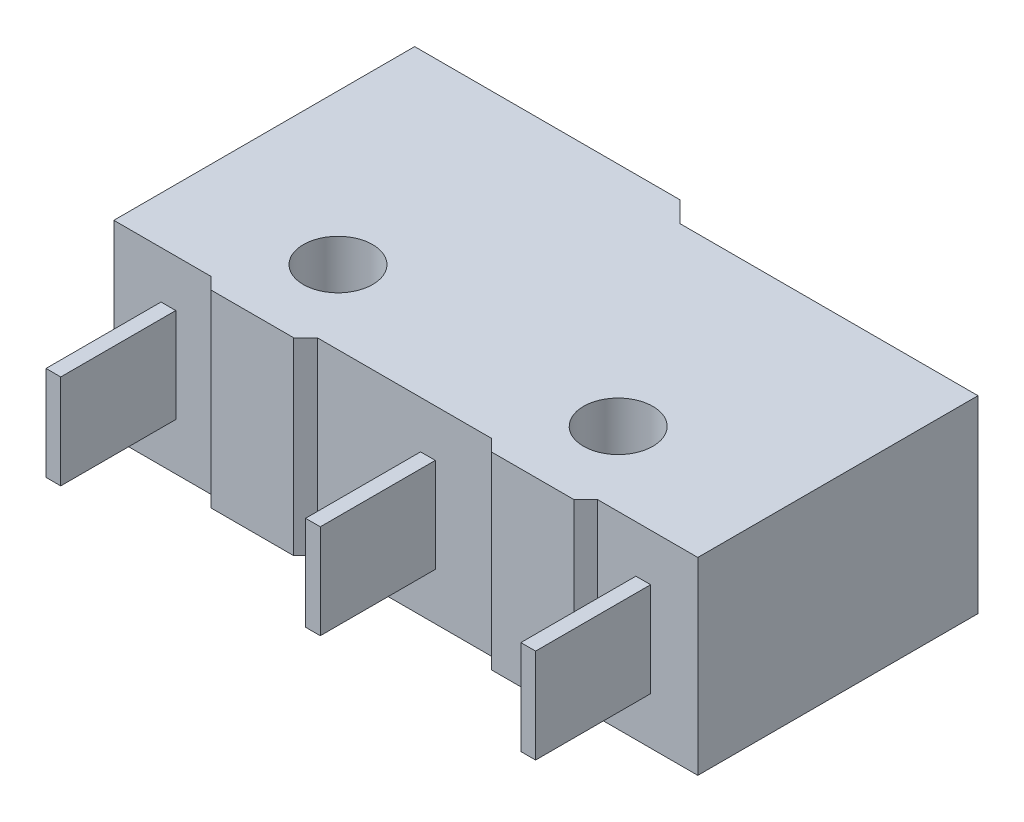
ISO-10303-21;
HEADER;
FILE_DESCRIPTION(('STEP AP214'),'2;1');
FILE_NAME('part.step','',(''),(''),'','','');
FILE_SCHEMA(('AUTOMOTIVE_DESIGN { 1 0 10303 214 1 1 1 1 }'));
ENDSEC;
DATA;
#1=APPLICATION_CONTEXT('core data for automotive mechanical design processes');
#2=APPLICATION_PROTOCOL_DEFINITION('international standard','automotive_design',2000,#1);
#3=PRODUCT_CONTEXT('',#1,'mechanical');
#4=PRODUCT('Part','Part','',(#3));
#5=PRODUCT_RELATED_PRODUCT_CATEGORY('part','',(#4));
#6=PRODUCT_DEFINITION_FORMATION('','',#4);
#7=PRODUCT_DEFINITION_CONTEXT('part definition',#1,'design');
#8=PRODUCT_DEFINITION('design','',#6,#7);
#9=PRODUCT_DEFINITION_SHAPE('','',#8);
#10=(LENGTH_UNIT() NAMED_UNIT(*) SI_UNIT(.MILLI.,.METRE.));
#11=(NAMED_UNIT(*) PLANE_ANGLE_UNIT() SI_UNIT($,.RADIAN.));
#12=(NAMED_UNIT(*) SI_UNIT($,.STERADIAN.) SOLID_ANGLE_UNIT());
#13=UNCERTAINTY_MEASURE_WITH_UNIT(LENGTH_MEASURE(1.E-05),#10,'distance_accuracy_value','');
#14=(GEOMETRIC_REPRESENTATION_CONTEXT(3) GLOBAL_UNCERTAINTY_ASSIGNED_CONTEXT((#13)) GLOBAL_UNIT_ASSIGNED_CONTEXT((#10,
#11,#12)) REPRESENTATION_CONTEXT('',''));
#15=CARTESIAN_POINT('',(0.,0.,0.));
#16=DIRECTION('',(0.,0.,1.));
#17=DIRECTION('',(1.,0.,0.));
#18=AXIS2_PLACEMENT_3D('',#15,#16,#17);
#19=CARTESIAN_POINT('',(11.3,6.4,2.5));
#20=DIRECTION('',(0.,0.,-1.));
#21=DIRECTION('',(-1.,0.,0.));
#22=AXIS2_PLACEMENT_3D('',#19,#20,#21);
#23=PLANE('',#22);
#24=DIRECTION('',(1.,0.,0.));
#25=VECTOR('',#24,1.);
#26=CARTESIAN_POINT('',(11.3,0.,2.5));
#27=LINE('',#26,#25);
#28=CARTESIAN_POINT('',(11.3,0.,2.5));
#29=VERTEX_POINT('',#28);
#30=CARTESIAN_POINT('',(14.7,0.,2.5));
#31=VERTEX_POINT('',#30);
#32=EDGE_CURVE('E489',#29,#31,#27,.T.);
#33=ORIENTED_EDGE('',*,*,#32,.T.);
#34=DIRECTION('',(0.,-1.,0.));
#35=VECTOR('',#34,1.);
#36=CARTESIAN_POINT('',(14.7,6.4,2.5));
#37=LINE('',#36,#35);
#38=CARTESIAN_POINT('',(14.7,6.4,2.5));
#39=VERTEX_POINT('',#38);
#40=EDGE_CURVE('E492',#39,#31,#37,.T.);
#41=ORIENTED_EDGE('',*,*,#40,.F.);
#42=DIRECTION('',(1.,0.,0.));
#43=VECTOR('',#42,1.);
#44=CARTESIAN_POINT('',(11.3,6.4,2.5));
#45=LINE('',#44,#43);
#46=CARTESIAN_POINT('',(11.3,6.4,2.5));
#47=VERTEX_POINT('',#46);
#48=EDGE_CURVE('E496',#47,#39,#45,.T.);
#49=ORIENTED_EDGE('',*,*,#48,.F.);
#50=DIRECTION('',(0.,-1.,0.));
#51=VECTOR('',#50,1.);
#52=CARTESIAN_POINT('',(11.3,6.4,2.5));
#53=LINE('',#52,#51);
#54=EDGE_CURVE('E495',#47,#29,#53,.T.);
#55=ORIENTED_EDGE('',*,*,#54,.T.);
#56=EDGE_LOOP('',(#33,#41,#49,#55));
#57=FACE_BOUND('',#56,.T.);
#58=DIRECTION('',(-1.,0.,0.));
#59=VECTOR('',#58,1.);
#60=CARTESIAN_POINT('',(12.6,1.6,2.5));
#61=LINE('',#60,#59);
#62=CARTESIAN_POINT('',(13.1,1.6,2.5));
#63=VERTEX_POINT('',#62);
#64=CARTESIAN_POINT('',(12.6,1.6,2.5));
#65=VERTEX_POINT('',#64);
#66=EDGE_CURVE('E255',#63,#65,#61,.T.);
#67=ORIENTED_EDGE('',*,*,#66,.T.);
#68=DIRECTION('',(0.,1.,0.));
#69=VECTOR('',#68,1.);
#70=CARTESIAN_POINT('',(12.6,1.6,2.5));
#71=LINE('',#70,#69);
#72=CARTESIAN_POINT('',(12.6,4.8,2.5));
#73=VERTEX_POINT('',#72);
#74=EDGE_CURVE('E239',#65,#73,#71,.T.);
#75=ORIENTED_EDGE('',*,*,#74,.T.);
#76=DIRECTION('',(-1.,0.,0.));
#77=VECTOR('',#76,1.);
#78=CARTESIAN_POINT('',(12.6,4.8,2.5));
#79=LINE('',#78,#77);
#80=CARTESIAN_POINT('',(13.1,4.8,2.5));
#81=VERTEX_POINT('',#80);
#82=EDGE_CURVE('E259',#81,#73,#79,.T.);
#83=ORIENTED_EDGE('',*,*,#82,.F.);
#84=DIRECTION('',(0.,1.,0.));
#85=VECTOR('',#84,1.);
#86=CARTESIAN_POINT('',(13.1,1.6,2.5));
#87=LINE('',#86,#85);
#88=EDGE_CURVE('E248',#63,#81,#87,.T.);
#89=ORIENTED_EDGE('',*,*,#88,.F.);
#90=EDGE_LOOP('',(#67,#75,#83,#89));
#91=FACE_BOUND('',#90,.T.);
#92=ADVANCED_FACE('F39',(#57,#91),#23,.F.);
#93=CARTESIAN_POINT('',(7.7,6.4,2.5));
#94=DIRECTION('',(0.,0.,-1.));
#95=DIRECTION('',(-1.,0.,0.));
#96=AXIS2_PLACEMENT_3D('',#93,#94,#95);
#97=PLANE('',#96);
#98=DIRECTION('',(1.,0.,0.));
#99=VECTOR('',#98,1.);
#100=CARTESIAN_POINT('',(7.7,0.,2.5));
#101=LINE('',#100,#99);
#102=CARTESIAN_POINT('',(1.8,0.,2.5));
#103=VERTEX_POINT('',#102);
#104=CARTESIAN_POINT('',(7.7,0.,2.5));
#105=VERTEX_POINT('',#104);
#106=EDGE_CURVE('E480',#103,#105,#101,.T.);
#107=ORIENTED_EDGE('',*,*,#106,.T.);
#108=DIRECTION('',(0.,-1.,0.));
#109=VECTOR('',#108,1.);
#110=CARTESIAN_POINT('',(7.7,6.4,2.5));
#111=LINE('',#110,#109);
#112=CARTESIAN_POINT('',(7.7,6.4,2.5));
#113=VERTEX_POINT('',#112);
#114=EDGE_CURVE('E505',#113,#105,#111,.T.);
#115=ORIENTED_EDGE('',*,*,#114,.F.);
#116=DIRECTION('',(1.,0.,0.));
#117=VECTOR('',#116,1.);
#118=CARTESIAN_POINT('',(7.7,6.4,2.5));
#119=LINE('',#118,#117);
#120=CARTESIAN_POINT('',(1.8,6.4,2.5));
#121=VERTEX_POINT('',#120);
#122=EDGE_CURVE('E546',#121,#113,#119,.T.);
#123=ORIENTED_EDGE('',*,*,#122,.F.);
#124=DIRECTION('',(0.,-1.,0.));
#125=VECTOR('',#124,1.);
#126=CARTESIAN_POINT('',(1.8,6.4,2.5));
#127=LINE('',#126,#125);
#128=EDGE_CURVE('E508',#121,#103,#127,.T.);
#129=ORIENTED_EDGE('',*,*,#128,.T.);
#130=EDGE_LOOP('',(#107,#115,#123,#129));
#131=FACE_BOUND('',#130,.T.);
#132=DIRECTION('',(-1.,0.,0.));
#133=VECTOR('',#132,1.);
#134=CARTESIAN_POINT('',(5.3,1.6,2.5));
#135=LINE('',#134,#133);
#136=CARTESIAN_POINT('',(5.8,1.6,2.5));
#137=VERTEX_POINT('',#136);
#138=CARTESIAN_POINT('',(5.3,1.6,2.5));
#139=VERTEX_POINT('',#138);
#140=EDGE_CURVE('E278',#137,#139,#135,.T.);
#141=ORIENTED_EDGE('',*,*,#140,.T.);
#142=DIRECTION('',(0.,1.,0.));
#143=VECTOR('',#142,1.);
#144=CARTESIAN_POINT('',(5.3,1.6,2.5));
#145=LINE('',#144,#143);
#146=CARTESIAN_POINT('',(5.3,4.8,2.5));
#147=VERTEX_POINT('',#146);
#148=EDGE_CURVE('E275',#139,#147,#145,.T.);
#149=ORIENTED_EDGE('',*,*,#148,.T.);
#150=DIRECTION('',(-1.,0.,0.));
#151=VECTOR('',#150,1.);
#152=CARTESIAN_POINT('',(5.3,4.8,2.5));
#153=LINE('',#152,#151);
#154=CARTESIAN_POINT('',(5.8,4.8,2.5));
#155=VERTEX_POINT('',#154);
#156=EDGE_CURVE('E295',#155,#147,#153,.T.);
#157=ORIENTED_EDGE('',*,*,#156,.F.);
#158=DIRECTION('',(0.,1.,0.));
#159=VECTOR('',#158,1.);
#160=CARTESIAN_POINT('',(5.8,1.6,2.5));
#161=LINE('',#160,#159);
#162=EDGE_CURVE('E281',#137,#155,#161,.T.);
#163=ORIENTED_EDGE('',*,*,#162,.F.);
#164=EDGE_LOOP('',(#141,#149,#157,#163));
#165=FACE_BOUND('',#164,.T.);
#166=ADVANCED_FACE('F396',(#131,#165),#97,.F.);
#167=CARTESIAN_POINT('',(-1.8,6.4,2.5));
#168=DIRECTION('',(0.,0.,-1.));
#169=DIRECTION('',(-1.,0.,0.));
#170=AXIS2_PLACEMENT_3D('',#167,#168,#169);
#171=PLANE('',#170);
#172=DIRECTION('',(1.,0.,0.));
#173=VECTOR('',#172,1.);
#174=CARTESIAN_POINT('',(-1.8,0.,2.5));
#175=LINE('',#174,#173);
#176=CARTESIAN_POINT('',(-5.1,0.,2.5));
#177=VERTEX_POINT('',#176);
#178=CARTESIAN_POINT('',(-1.8,0.,2.5));
#179=VERTEX_POINT('',#178);
#180=EDGE_CURVE('E471',#177,#179,#175,.T.);
#181=ORIENTED_EDGE('',*,*,#180,.T.);
#182=DIRECTION('',(0.,-1.,0.));
#183=VECTOR('',#182,1.);
#184=CARTESIAN_POINT('',(-1.8,6.4,2.5));
#185=LINE('',#184,#183);
#186=CARTESIAN_POINT('',(-1.8,6.4,2.5));
#187=VERTEX_POINT('',#186);
#188=EDGE_CURVE('E517',#187,#179,#185,.T.);
#189=ORIENTED_EDGE('',*,*,#188,.F.);
#190=DIRECTION('',(1.,0.,0.));
#191=VECTOR('',#190,1.);
#192=CARTESIAN_POINT('',(-1.8,6.4,2.5));
#193=LINE('',#192,#191);
#194=CARTESIAN_POINT('',(-5.1,6.4,2.5));
#195=VERTEX_POINT('',#194);
#196=EDGE_CURVE('E533',#195,#187,#193,.T.);
#197=ORIENTED_EDGE('',*,*,#196,.F.);
#198=DIRECTION('',(0.,-1.,0.));
#199=VECTOR('',#198,1.);
#200=CARTESIAN_POINT('',(-5.1,6.4,2.5));
#201=LINE('',#200,#199);
#202=EDGE_CURVE('E520',#195,#177,#201,.T.);
#203=ORIENTED_EDGE('',*,*,#202,.T.);
#204=EDGE_LOOP('',(#181,#189,#197,#203));
#205=FACE_BOUND('',#204,.T.);
#206=DIRECTION('',(-1.,0.,0.));
#207=VECTOR('',#206,1.);
#208=CARTESIAN_POINT('',(-3.5,1.6,2.5));
#209=LINE('',#208,#207);
#210=CARTESIAN_POINT('',(-3.,1.6,2.5));
#211=VERTEX_POINT('',#210);
#212=CARTESIAN_POINT('',(-3.5,1.6,2.5));
#213=VERTEX_POINT('',#212);
#214=EDGE_CURVE('E321',#211,#213,#209,.T.);
#215=ORIENTED_EDGE('',*,*,#214,.T.);
#216=DIRECTION('',(0.,1.,0.));
#217=VECTOR('',#216,1.);
#218=CARTESIAN_POINT('',(-3.5,1.6,2.5));
#219=LINE('',#218,#217);
#220=CARTESIAN_POINT('',(-3.5,4.8,2.5));
#221=VERTEX_POINT('',#220);
#222=EDGE_CURVE('E325',#213,#221,#219,.T.);
#223=ORIENTED_EDGE('',*,*,#222,.T.);
#224=DIRECTION('',(-1.,0.,0.));
#225=VECTOR('',#224,1.);
#226=CARTESIAN_POINT('',(-3.5,4.8,2.5));
#227=LINE('',#226,#225);
#228=CARTESIAN_POINT('',(-3.,4.8,2.5));
#229=VERTEX_POINT('',#228);
#230=EDGE_CURVE('E311',#229,#221,#227,.T.);
#231=ORIENTED_EDGE('',*,*,#230,.F.);
#232=DIRECTION('',(0.,1.,0.));
#233=VECTOR('',#232,1.);
#234=CARTESIAN_POINT('',(-3.,1.6,2.5));
#235=LINE('',#234,#233);
#236=EDGE_CURVE('E329',#211,#229,#235,.T.);
#237=ORIENTED_EDGE('',*,*,#236,.F.);
#238=EDGE_LOOP('',(#215,#223,#231,#237));
#239=FACE_BOUND('',#238,.T.);
#240=ADVANCED_FACE('F412',(#205,#239),#171,.F.);
#241=CARTESIAN_POINT('',(-5.1,6.4,-7.7));
#242=DIRECTION('',(0.,0.,1.));
#243=DIRECTION('',(1.,0.,0.));
#244=AXIS2_PLACEMENT_3D('',#241,#242,#243);
#245=PLANE('',#244);
#246=DIRECTION('',(-1.,0.,0.));
#247=VECTOR('',#246,1.);
#248=CARTESIAN_POINT('',(-5.1,0.,-7.7));
#249=LINE('',#248,#247);
#250=CARTESIAN_POINT('',(3.9,0.,-7.7));
#251=VERTEX_POINT('',#250);
#252=CARTESIAN_POINT('',(-5.1,0.,-7.7));
#253=VERTEX_POINT('',#252);
#254=EDGE_CURVE('E464',#251,#253,#249,.T.);
#255=ORIENTED_EDGE('',*,*,#254,.T.);
#256=DIRECTION('',(0.,-1.,0.));
#257=VECTOR('',#256,1.);
#258=CARTESIAN_POINT('',(-5.1,6.4,-7.7));
#259=LINE('',#258,#257);
#260=CARTESIAN_POINT('',(-5.1,6.4,-7.7));
#261=VERTEX_POINT('',#260);
#262=EDGE_CURVE('E523',#261,#253,#259,.T.);
#263=ORIENTED_EDGE('',*,*,#262,.F.);
#264=DIRECTION('',(-1.,0.,0.));
#265=VECTOR('',#264,1.);
#266=CARTESIAN_POINT('',(-5.1,6.4,-7.7));
#267=LINE('',#266,#265);
#268=CARTESIAN_POINT('',(3.9,6.4,-7.7));
#269=VERTEX_POINT('',#268);
#270=EDGE_CURVE('E529',#269,#261,#267,.T.);
#271=ORIENTED_EDGE('',*,*,#270,.F.);
#272=DIRECTION('',(0.,-1.,0.));
#273=VECTOR('',#272,1.);
#274=CARTESIAN_POINT('',(3.9,6.4,-7.7));
#275=LINE('',#274,#273);
#276=EDGE_CURVE('E460',#269,#251,#275,.T.);
#277=ORIENTED_EDGE('',*,*,#276,.T.);
#278=EDGE_LOOP('',(#255,#263,#271,#277));
#279=FACE_BOUND('',#278,.T.);
#280=DIRECTION('',(1.,0.,0.));
#281=VECTOR('',#280,1.);
#282=CARTESIAN_POINT('',(3.,1.6,-7.7));
#283=LINE('',#282,#281);
#284=CARTESIAN_POINT('',(1.,1.6,-7.7));
#285=VERTEX_POINT('',#284);
#286=CARTESIAN_POINT('',(3.,1.6,-7.7));
#287=VERTEX_POINT('',#286);
#288=EDGE_CURVE('E639',#285,#287,#283,.T.);
#289=ORIENTED_EDGE('',*,*,#288,.T.);
#290=DIRECTION('',(0.,1.,0.));
#291=VECTOR('',#290,1.);
#292=CARTESIAN_POINT('',(3.,1.6,-7.7));
#293=LINE('',#292,#291);
#294=CARTESIAN_POINT('',(3.,4.8,-7.7));
#295=VERTEX_POINT('',#294);
#296=EDGE_CURVE('E643',#287,#295,#293,.T.);
#297=ORIENTED_EDGE('',*,*,#296,.T.);
#298=DIRECTION('',(1.,0.,0.));
#299=VECTOR('',#298,1.);
#300=CARTESIAN_POINT('',(3.,4.8,-7.7));
#301=LINE('',#300,#299);
#302=CARTESIAN_POINT('',(1.,4.8,-7.7));
#303=VERTEX_POINT('',#302);
#304=EDGE_CURVE('E347',#303,#295,#301,.T.);
#305=ORIENTED_EDGE('',*,*,#304,.F.);
#306=DIRECTION('',(0.,1.,0.));
#307=VECTOR('',#306,1.);
#308=CARTESIAN_POINT('',(1.,1.6,-7.7));
#309=LINE('',#308,#307);
#310=EDGE_CURVE('E645',#285,#303,#309,.T.);
#311=ORIENTED_EDGE('',*,*,#310,.F.);
#312=EDGE_LOOP('',(#289,#297,#305,#311));
#313=FACE_BOUND('',#312,.T.);
#314=ADVANCED_FACE('F389',(#279,#313),#245,.F.);
#315=CARTESIAN_POINT('',(0.,6.4,0.));
#316=DIRECTION('',(0.,-1.,0.));
#317=DIRECTION('',(0.,0.,-1.));
#318=AXIS2_PLACEMENT_3D('',#315,#316,#317);
#319=PLANE('',#318);
#320=DIRECTION('',(0.,0.,-1.));
#321=VECTOR('',#320,1.);
#322=CARTESIAN_POINT('',(14.7,6.4,2.5));
#323=LINE('',#322,#321);
#324=CARTESIAN_POINT('',(14.7,6.4,-7.));
#325=VERTEX_POINT('',#324);
#326=EDGE_CURVE('E491',#39,#325,#323,.T.);
#327=ORIENTED_EDGE('',*,*,#326,.T.);
#328=DIRECTION('',(-1.,0.,0.));
#329=VECTOR('',#328,1.);
#330=CARTESIAN_POINT('',(4.59999999999999,6.4,-7.));
#331=LINE('',#330,#329);
#332=CARTESIAN_POINT('',(4.59999999999999,6.4,-7.));
#333=VERTEX_POINT('',#332);
#334=EDGE_CURVE('E535',#325,#333,#331,.T.);
#335=ORIENTED_EDGE('',*,*,#334,.T.);
#336=DIRECTION('',(-0.707106781186544,0.,-0.707106781186551));
#337=VECTOR('',#336,1.);
#338=CARTESIAN_POINT('',(3.9,6.4,-7.7));
#339=LINE('',#338,#337);
#340=EDGE_CURVE('E459',#333,#269,#339,.T.);
#341=ORIENTED_EDGE('',*,*,#340,.T.);
#342=ORIENTED_EDGE('',*,*,#270,.T.);
#343=DIRECTION('',(0.,0.,1.));
#344=VECTOR('',#343,1.);
#345=CARTESIAN_POINT('',(-5.1,6.4,2.5));
#346=LINE('',#345,#344);
#347=EDGE_CURVE('E531',#261,#195,#346,.T.);
#348=ORIENTED_EDGE('',*,*,#347,.T.);
#349=ORIENTED_EDGE('',*,*,#196,.T.);
#350=DIRECTION('',(0.707106781186546,0.,0.707106781186549));
#351=VECTOR('',#350,1.);
#352=CARTESIAN_POINT('',(-1.4,6.4,2.9));
#353=LINE('',#352,#351);
#354=CARTESIAN_POINT('',(-1.4,6.4,2.9));
#355=VERTEX_POINT('',#354);
#356=EDGE_CURVE('E540',#187,#355,#353,.T.);
#357=ORIENTED_EDGE('',*,*,#356,.T.);
#358=DIRECTION('',(1.,0.,0.));
#359=VECTOR('',#358,1.);
#360=CARTESIAN_POINT('',(0.,6.4,2.9));
#361=LINE('',#360,#359);
#362=CARTESIAN_POINT('',(1.4,6.4,2.9));
#363=VERTEX_POINT('',#362);
#364=EDGE_CURVE('E542',#355,#363,#361,.T.);
#365=ORIENTED_EDGE('',*,*,#364,.T.);
#366=DIRECTION('',(0.707106781186546,0.,-0.707106781186549));
#367=VECTOR('',#366,1.);
#368=CARTESIAN_POINT('',(1.4,6.4,2.9));
#369=LINE('',#368,#367);
#370=EDGE_CURVE('E544',#363,#121,#369,.T.);
#371=ORIENTED_EDGE('',*,*,#370,.T.);
#372=ORIENTED_EDGE('',*,*,#122,.T.);
#373=DIRECTION('',(0.707106781186548,0.,0.707106781186547));
#374=VECTOR('',#373,1.);
#375=CARTESIAN_POINT('',(8.1,6.4,2.9));
#376=LINE('',#375,#374);
#377=CARTESIAN_POINT('',(8.1,6.4,2.9));
#378=VERTEX_POINT('',#377);
#379=EDGE_CURVE('E548',#113,#378,#376,.T.);
#380=ORIENTED_EDGE('',*,*,#379,.T.);
#381=DIRECTION('',(1.,0.,0.));
#382=VECTOR('',#381,1.);
#383=CARTESIAN_POINT('',(9.5,6.4,2.9));
#384=LINE('',#383,#382);
#385=CARTESIAN_POINT('',(10.9,6.4,2.9));
#386=VERTEX_POINT('',#385);
#387=EDGE_CURVE('E550',#378,#386,#384,.T.);
#388=ORIENTED_EDGE('',*,*,#387,.T.);
#389=DIRECTION('',(0.707106781186545,0.,-0.707106781186549));
#390=VECTOR('',#389,1.);
#391=CARTESIAN_POINT('',(10.9,6.4,2.9));
#392=LINE('',#391,#390);
#393=EDGE_CURVE('E552',#386,#47,#392,.T.);
#394=ORIENTED_EDGE('',*,*,#393,.T.);
#395=ORIENTED_EDGE('',*,*,#48,.T.);
#396=EDGE_LOOP('',(#327,#335,#341,#342,#348,#349,#357,#365,#371,#372,#380,#388,#394,#395));
#397=FACE_BOUND('',#396,.T.);
#398=CARTESIAN_POINT('',(0.,6.4,0.));
#399=DIRECTION('',(0.,1.,0.));
#400=DIRECTION('',(0.,0.,1.));
#401=AXIS2_PLACEMENT_3D('',#398,#399,#400);
#402=CIRCLE('',#401,1.175);
#403=CARTESIAN_POINT('',(0.,6.4,1.175));
#404=VERTEX_POINT('',#403);
#405=EDGE_CURVE('E554',#404,#404,#402,.T.);
#406=ORIENTED_EDGE('',*,*,#405,.F.);
#407=EDGE_LOOP('',(#406));
#408=FACE_BOUND('',#407,.T.);
#409=CARTESIAN_POINT('',(9.5,6.4,0.));
#410=DIRECTION('',(0.,1.,0.));
#411=DIRECTION('',(0.,0.,1.));
#412=AXIS2_PLACEMENT_3D('',#409,#410,#411);
#413=CIRCLE('',#412,1.175);
#414=CARTESIAN_POINT('',(9.5,6.4,1.175));
#415=VERTEX_POINT('',#414);
#416=EDGE_CURVE('E560',#415,#415,#413,.T.);
#417=ORIENTED_EDGE('',*,*,#416,.F.);
#418=EDGE_LOOP('',(#417));
#419=FACE_BOUND('',#418,.T.);
#420=ADVANCED_FACE('F385',(#397,#408,#419),#319,.F.);
#421=CARTESIAN_POINT('',(0.,0.,0.));
#422=DIRECTION('',(0.,-1.,0.));
#423=DIRECTION('',(0.,0.,-1.));
#424=AXIS2_PLACEMENT_3D('',#421,#422,#423);
#425=PLANE('',#424);
#426=CARTESIAN_POINT('',(0.,0.,0.));
#427=DIRECTION('',(0.,1.,0.));
#428=DIRECTION('',(0.,0.,1.));
#429=AXIS2_PLACEMENT_3D('',#426,#427,#428);
#430=CIRCLE('',#429,1.175);
#431=CARTESIAN_POINT('',(0.,0.,1.175));
#432=VERTEX_POINT('',#431);
#433=EDGE_CURVE('E556',#432,#432,#430,.T.);
#434=ORIENTED_EDGE('',*,*,#433,.T.);
#435=EDGE_LOOP('',(#434));
#436=FACE_BOUND('',#435,.T.);
#437=DIRECTION('',(0.,0.,-1.));
#438=VECTOR('',#437,1.);
#439=CARTESIAN_POINT('',(14.7,0.,2.5));
#440=LINE('',#439,#438);
#441=CARTESIAN_POINT('',(14.7,0.,-7.));
#442=VERTEX_POINT('',#441);
#443=EDGE_CURVE('E455',#31,#442,#440,.T.);
#444=ORIENTED_EDGE('',*,*,#443,.F.);
#445=ORIENTED_EDGE('',*,*,#32,.F.);
#446=DIRECTION('',(0.707106781186545,0.,-0.707106781186549));
#447=VECTOR('',#446,1.);
#448=CARTESIAN_POINT('',(10.9,0.,2.9));
#449=LINE('',#448,#447);
#450=CARTESIAN_POINT('',(10.9,0.,2.9));
#451=VERTEX_POINT('',#450);
#452=EDGE_CURVE('E487',#451,#29,#449,.T.);
#453=ORIENTED_EDGE('',*,*,#452,.F.);
#454=DIRECTION('',(1.,0.,0.));
#455=VECTOR('',#454,1.);
#456=CARTESIAN_POINT('',(9.5,0.,2.9));
#457=LINE('',#456,#455);
#458=CARTESIAN_POINT('',(8.1,0.,2.9));
#459=VERTEX_POINT('',#458);
#460=EDGE_CURVE('E485',#459,#451,#457,.T.);
#461=ORIENTED_EDGE('',*,*,#460,.F.);
#462=DIRECTION('',(0.707106781186548,0.,0.707106781186547));
#463=VECTOR('',#462,1.);
#464=CARTESIAN_POINT('',(8.1,0.,2.9));
#465=LINE('',#464,#463);
#466=EDGE_CURVE('E482',#105,#459,#465,.T.);
#467=ORIENTED_EDGE('',*,*,#466,.F.);
#468=ORIENTED_EDGE('',*,*,#106,.F.);
#469=DIRECTION('',(0.707106781186546,0.,-0.707106781186549));
#470=VECTOR('',#469,1.);
#471=CARTESIAN_POINT('',(1.4,0.,2.9));
#472=LINE('',#471,#470);
#473=CARTESIAN_POINT('',(1.4,0.,2.9));
#474=VERTEX_POINT('',#473);
#475=EDGE_CURVE('E478',#474,#103,#472,.T.);
#476=ORIENTED_EDGE('',*,*,#475,.F.);
#477=DIRECTION('',(1.,0.,0.));
#478=VECTOR('',#477,1.);
#479=CARTESIAN_POINT('',(0.,0.,2.9));
#480=LINE('',#479,#478);
#481=CARTESIAN_POINT('',(-1.4,0.,2.9));
#482=VERTEX_POINT('',#481);
#483=EDGE_CURVE('E476',#482,#474,#480,.T.);
#484=ORIENTED_EDGE('',*,*,#483,.F.);
#485=DIRECTION('',(0.707106781186546,0.,0.707106781186549));
#486=VECTOR('',#485,1.);
#487=CARTESIAN_POINT('',(-1.4,0.,2.9));
#488=LINE('',#487,#486);
#489=EDGE_CURVE('E473',#179,#482,#488,.T.);
#490=ORIENTED_EDGE('',*,*,#489,.F.);
#491=ORIENTED_EDGE('',*,*,#180,.F.);
#492=DIRECTION('',(0.,0.,1.));
#493=VECTOR('',#492,1.);
#494=CARTESIAN_POINT('',(-5.1,0.,2.5));
#495=LINE('',#494,#493);
#496=EDGE_CURVE('E466',#253,#177,#495,.T.);
#497=ORIENTED_EDGE('',*,*,#496,.F.);
#498=ORIENTED_EDGE('',*,*,#254,.F.);
#499=DIRECTION('',(-0.707106781186544,0.,-0.707106781186551));
#500=VECTOR('',#499,1.);
#501=CARTESIAN_POINT('',(3.9,0.,-7.7));
#502=LINE('',#501,#500);
#503=CARTESIAN_POINT('',(4.59999999999999,0.,-7.));
#504=VERTEX_POINT('',#503);
#505=EDGE_CURVE('E454',#504,#251,#502,.T.);
#506=ORIENTED_EDGE('',*,*,#505,.F.);
#507=DIRECTION('',(-1.,0.,0.));
#508=VECTOR('',#507,1.);
#509=CARTESIAN_POINT('',(4.59999999999999,0.,-7.));
#510=LINE('',#509,#508);
#511=EDGE_CURVE('E446',#442,#504,#510,.T.);
#512=ORIENTED_EDGE('',*,*,#511,.F.);
#513=EDGE_LOOP('',(#444,#445,#453,#461,#467,#468,#476,#484,#490,#491,#497,#498,#506,#512));
#514=FACE_BOUND('',#513,.T.);
#515=CARTESIAN_POINT('',(9.5,0.,0.));
#516=DIRECTION('',(0.,1.,0.));
#517=DIRECTION('',(0.,0.,1.));
#518=AXIS2_PLACEMENT_3D('',#515,#516,#517);
#519=CIRCLE('',#518,1.175);
#520=CARTESIAN_POINT('',(9.5,0.,1.175));
#521=VERTEX_POINT('',#520);
#522=EDGE_CURVE('E563',#521,#521,#519,.T.);
#523=ORIENTED_EDGE('',*,*,#522,.T.);
#524=EDGE_LOOP('',(#523));
#525=FACE_BOUND('',#524,.T.);
#526=ADVANCED_FACE('F388',(#436,#514,#525),#425,.T.);
#527=CARTESIAN_POINT('',(14.7,6.4,2.5));
#528=DIRECTION('',(-1.,0.,0.));
#529=DIRECTION('',(0.,0.,1.));
#530=AXIS2_PLACEMENT_3D('',#527,#528,#529);
#531=PLANE('',#530);
#532=ORIENTED_EDGE('',*,*,#443,.T.);
#533=DIRECTION('',(0.,-1.,0.));
#534=VECTOR('',#533,1.);
#535=CARTESIAN_POINT('',(14.7,6.4,-7.));
#536=LINE('',#535,#534);
#537=EDGE_CURVE('E11',#325,#442,#536,.T.);
#538=ORIENTED_EDGE('',*,*,#537,.F.);
#539=ORIENTED_EDGE('',*,*,#326,.F.);
#540=ORIENTED_EDGE('',*,*,#40,.T.);
#541=EDGE_LOOP('',(#532,#538,#539,#540));
#542=FACE_BOUND('',#541,.T.);
#543=ADVANCED_FACE('F41',(#542),#531,.F.);
#544=CARTESIAN_POINT('',(4.59999999999999,6.4,-7.));
#545=DIRECTION('',(0.,0.,1.));
#546=DIRECTION('',(1.,0.,0.));
#547=AXIS2_PLACEMENT_3D('',#544,#545,#546);
#548=PLANE('',#547);
#549=ORIENTED_EDGE('',*,*,#511,.T.);
#550=DIRECTION('',(0.,-1.,0.));
#551=VECTOR('',#550,1.);
#552=CARTESIAN_POINT('',(4.59999999999999,6.4,-7.));
#553=LINE('',#552,#551);
#554=EDGE_CURVE('E47',#333,#504,#553,.T.);
#555=ORIENTED_EDGE('',*,*,#554,.F.);
#556=ORIENTED_EDGE('',*,*,#334,.F.);
#557=ORIENTED_EDGE('',*,*,#537,.T.);
#558=EDGE_LOOP('',(#549,#555,#556,#557));
#559=FACE_BOUND('',#558,.T.);
#560=ADVANCED_FACE('F437',(#559),#548,.F.);
#561=CARTESIAN_POINT('',(3.9,6.4,-7.7));
#562=DIRECTION('',(-0.707106781186551,0.,0.707106781186545));
#563=DIRECTION('',(0.707106781186545,0.,0.707106781186551));
#564=AXIS2_PLACEMENT_3D('',#561,#562,#563);
#565=PLANE('',#564);
#566=ORIENTED_EDGE('',*,*,#505,.T.);
#567=ORIENTED_EDGE('',*,*,#276,.F.);
#568=ORIENTED_EDGE('',*,*,#340,.F.);
#569=ORIENTED_EDGE('',*,*,#554,.T.);
#570=EDGE_LOOP('',(#566,#567,#568,#569));
#571=FACE_BOUND('',#570,.T.);
#572=ADVANCED_FACE('F431',(#571),#565,.F.);
#573=CARTESIAN_POINT('',(-5.1,6.4,2.5));
#574=DIRECTION('',(1.,0.,0.));
#575=DIRECTION('',(0.,0.,-1.));
#576=AXIS2_PLACEMENT_3D('',#573,#574,#575);
#577=PLANE('',#576);
#578=ORIENTED_EDGE('',*,*,#496,.T.);
#579=ORIENTED_EDGE('',*,*,#202,.F.);
#580=ORIENTED_EDGE('',*,*,#347,.F.);
#581=ORIENTED_EDGE('',*,*,#262,.T.);
#582=EDGE_LOOP('',(#578,#579,#580,#581));
#583=FACE_BOUND('',#582,.T.);
#584=ADVANCED_FACE('F424',(#583),#577,.F.);
#585=CARTESIAN_POINT('',(-1.4,6.4,2.9));
#586=DIRECTION('',(0.707106781186549,0.,-0.707106781186546));
#587=DIRECTION('',(-0.707106781186546,0.,-0.707106781186549));
#588=AXIS2_PLACEMENT_3D('',#585,#586,#587);
#589=PLANE('',#588);
#590=ORIENTED_EDGE('',*,*,#489,.T.);
#591=DIRECTION('',(0.,-1.,0.));
#592=VECTOR('',#591,1.);
#593=CARTESIAN_POINT('',(-1.4,6.4,2.9));
#594=LINE('',#593,#592);
#595=EDGE_CURVE('E514',#355,#482,#594,.T.);
#596=ORIENTED_EDGE('',*,*,#595,.F.);
#597=ORIENTED_EDGE('',*,*,#356,.F.);
#598=ORIENTED_EDGE('',*,*,#188,.T.);
#599=EDGE_LOOP('',(#590,#596,#597,#598));
#600=FACE_BOUND('',#599,.T.);
#601=ADVANCED_FACE('F420',(#600),#589,.F.);
#602=CARTESIAN_POINT('',(0.,6.4,2.9));
#603=DIRECTION('',(0.,0.,-1.));
#604=DIRECTION('',(-1.,0.,0.));
#605=AXIS2_PLACEMENT_3D('',#602,#603,#604);
#606=PLANE('',#605);
#607=ORIENTED_EDGE('',*,*,#483,.T.);
#608=DIRECTION('',(0.,-1.,0.));
#609=VECTOR('',#608,1.);
#610=CARTESIAN_POINT('',(1.4,6.4,2.9));
#611=LINE('',#610,#609);
#612=EDGE_CURVE('E511',#363,#474,#611,.T.);
#613=ORIENTED_EDGE('',*,*,#612,.F.);
#614=ORIENTED_EDGE('',*,*,#364,.F.);
#615=ORIENTED_EDGE('',*,*,#595,.T.);
#616=EDGE_LOOP('',(#607,#613,#614,#615));
#617=FACE_BOUND('',#616,.T.);
#618=ADVANCED_FACE('F416',(#617),#606,.F.);
#619=CARTESIAN_POINT('',(1.4,6.4,2.9));
#620=DIRECTION('',(-0.707106781186549,0.,-0.707106781186546));
#621=DIRECTION('',(-0.707106781186546,0.,0.707106781186549));
#622=AXIS2_PLACEMENT_3D('',#619,#620,#621);
#623=PLANE('',#622);
#624=ORIENTED_EDGE('',*,*,#475,.T.);
#625=ORIENTED_EDGE('',*,*,#128,.F.);
#626=ORIENTED_EDGE('',*,*,#370,.F.);
#627=ORIENTED_EDGE('',*,*,#612,.T.);
#628=EDGE_LOOP('',(#624,#625,#626,#627));
#629=FACE_BOUND('',#628,.T.);
#630=ADVANCED_FACE('F408',(#629),#623,.F.);
#631=CARTESIAN_POINT('',(8.1,6.4,2.9));
#632=DIRECTION('',(0.707106781186547,0.,-0.707106781186548));
#633=DIRECTION('',(-0.707106781186548,0.,-0.707106781186547));
#634=AXIS2_PLACEMENT_3D('',#631,#632,#633);
#635=PLANE('',#634);
#636=ORIENTED_EDGE('',*,*,#466,.T.);
#637=DIRECTION('',(0.,-1.,0.));
#638=VECTOR('',#637,1.);
#639=CARTESIAN_POINT('',(8.1,6.4,2.9));
#640=LINE('',#639,#638);
#641=EDGE_CURVE('E502',#378,#459,#640,.T.);
#642=ORIENTED_EDGE('',*,*,#641,.F.);
#643=ORIENTED_EDGE('',*,*,#379,.F.);
#644=ORIENTED_EDGE('',*,*,#114,.T.);
#645=EDGE_LOOP('',(#636,#642,#643,#644));
#646=FACE_BOUND('',#645,.T.);
#647=ADVANCED_FACE('F404',(#646),#635,.F.);
#648=CARTESIAN_POINT('',(9.5,6.4,2.9));
#649=DIRECTION('',(0.,0.,-1.));
#650=DIRECTION('',(-1.,0.,0.));
#651=AXIS2_PLACEMENT_3D('',#648,#649,#650);
#652=PLANE('',#651);
#653=ORIENTED_EDGE('',*,*,#460,.T.);
#654=DIRECTION('',(0.,-1.,0.));
#655=VECTOR('',#654,1.);
#656=CARTESIAN_POINT('',(10.9,6.4,2.9));
#657=LINE('',#656,#655);
#658=EDGE_CURVE('E499',#386,#451,#657,.T.);
#659=ORIENTED_EDGE('',*,*,#658,.F.);
#660=ORIENTED_EDGE('',*,*,#387,.F.);
#661=ORIENTED_EDGE('',*,*,#641,.T.);
#662=EDGE_LOOP('',(#653,#659,#660,#661));
#663=FACE_BOUND('',#662,.T.);
#664=ADVANCED_FACE('F400',(#663),#652,.F.);
#665=CARTESIAN_POINT('',(10.9,6.4,2.9));
#666=DIRECTION('',(-0.707106781186549,0.,-0.707106781186545));
#667=DIRECTION('',(-0.707106781186546,0.,0.70710678118655));
#668=AXIS2_PLACEMENT_3D('',#665,#666,#667);
#669=PLANE('',#668);
#670=ORIENTED_EDGE('',*,*,#452,.T.);
#671=ORIENTED_EDGE('',*,*,#54,.F.);
#672=ORIENTED_EDGE('',*,*,#393,.F.);
#673=ORIENTED_EDGE('',*,*,#658,.T.);
#674=EDGE_LOOP('',(#670,#671,#672,#673));
#675=FACE_BOUND('',#674,.T.);
#676=ADVANCED_FACE('F383',(#675),#669,.F.);
#677=CARTESIAN_POINT('',(0.,6.4,0.));
#678=DIRECTION('',(0.,-1.,0.));
#679=DIRECTION('',(0.,0.,-1.));
#680=AXIS2_PLACEMENT_3D('',#677,#678,#679);
#681=CYLINDRICAL_SURFACE('',#680,1.175);
#682=ORIENTED_EDGE('',*,*,#405,.T.);
#683=EDGE_LOOP('',(#682));
#684=FACE_BOUND('',#683,.T.);
#685=ORIENTED_EDGE('',*,*,#433,.F.);
#686=EDGE_LOOP('',(#685));
#687=FACE_BOUND('',#686,.T.);
#688=ADVANCED_FACE('F379',(#684,#687),#681,.F.);
#689=CARTESIAN_POINT('',(9.5,6.4,0.));
#690=DIRECTION('',(0.,-1.,0.));
#691=DIRECTION('',(0.,0.,-1.));
#692=AXIS2_PLACEMENT_3D('',#689,#690,#691);
#693=CYLINDRICAL_SURFACE('',#692,1.175);
#694=ORIENTED_EDGE('',*,*,#416,.T.);
#695=EDGE_LOOP('',(#694));
#696=FACE_BOUND('',#695,.T.);
#697=ORIENTED_EDGE('',*,*,#522,.F.);
#698=EDGE_LOOP('',(#697));
#699=FACE_BOUND('',#698,.T.);
#700=ADVANCED_FACE('F375',(#696,#699),#693,.F.);
#701=CARTESIAN_POINT('',(3.,1.6,-7.7));
#702=DIRECTION('',(1.,0.,0.));
#703=DIRECTION('',(0.,0.,-1.));
#704=AXIS2_PLACEMENT_3D('',#701,#702,#703);
#705=PLANE('',#704);
#706=DIRECTION('',(0.,1.,0.));
#707=VECTOR('',#706,1.);
#708=CARTESIAN_POINT('',(3.,1.6,-7.954));
#709=LINE('',#708,#707);
#710=CARTESIAN_POINT('',(3.,1.6,-7.954));
#711=VERTEX_POINT('',#710);
#712=CARTESIAN_POINT('',(3.,4.8,-7.954));
#713=VERTEX_POINT('',#712);
#714=EDGE_CURVE('E646',#711,#713,#709,.T.);
#715=ORIENTED_EDGE('',*,*,#714,.T.);
#716=DIRECTION('',(0.,0.,-1.));
#717=VECTOR('',#716,1.);
#718=CARTESIAN_POINT('',(3.,4.8,-7.7));
#719=LINE('',#718,#717);
#720=EDGE_CURVE('E328',#295,#713,#719,.T.);
#721=ORIENTED_EDGE('',*,*,#720,.F.);
#722=ORIENTED_EDGE('',*,*,#296,.F.);
#723=DIRECTION('',(0.,0.,-1.));
#724=VECTOR('',#723,1.);
#725=CARTESIAN_POINT('',(3.,1.6,-7.7));
#726=LINE('',#725,#724);
#727=EDGE_CURVE('E349',#287,#711,#726,.T.);
#728=ORIENTED_EDGE('',*,*,#727,.T.);
#729=EDGE_LOOP('',(#715,#721,#722,#728));
#730=FACE_BOUND('',#729,.T.);
#731=ADVANCED_FACE('F372',(#730),#705,.T.);
#732=CARTESIAN_POINT('',(1.,1.6,-7.7));
#733=DIRECTION('',(-1.,0.,0.));
#734=DIRECTION('',(0.,0.,1.));
#735=AXIS2_PLACEMENT_3D('',#732,#733,#734);
#736=PLANE('',#735);
#737=ORIENTED_EDGE('',*,*,#310,.T.);
#738=DIRECTION('',(0.,0.,1.));
#739=VECTOR('',#738,1.);
#740=CARTESIAN_POINT('',(1.,4.8,-7.7));
#741=LINE('',#740,#739);
#742=CARTESIAN_POINT('',(1.,4.8,-7.954));
#743=VERTEX_POINT('',#742);
#744=EDGE_CURVE('E342',#743,#303,#741,.T.);
#745=ORIENTED_EDGE('',*,*,#744,.F.);
#746=DIRECTION('',(0.,1.,0.));
#747=VECTOR('',#746,1.);
#748=CARTESIAN_POINT('',(1.,1.6,-7.954));
#749=LINE('',#748,#747);
#750=CARTESIAN_POINT('',(1.,1.6,-7.954));
#751=VERTEX_POINT('',#750);
#752=EDGE_CURVE('E647',#751,#743,#749,.T.);
#753=ORIENTED_EDGE('',*,*,#752,.F.);
#754=DIRECTION('',(0.,0.,1.));
#755=VECTOR('',#754,1.);
#756=CARTESIAN_POINT('',(1.,1.6,-7.7));
#757=LINE('',#756,#755);
#758=EDGE_CURVE('E358',#751,#285,#757,.T.);
#759=ORIENTED_EDGE('',*,*,#758,.T.);
#760=EDGE_LOOP('',(#737,#745,#753,#759));
#761=FACE_BOUND('',#760,.T.);
#762=ADVANCED_FACE('F369',(#761),#736,.T.);
#763=CARTESIAN_POINT('',(3.,1.6,-7.954));
#764=CARTESIAN_POINT('',(2.,1.6,-9.1224));
#765=CARTESIAN_POINT('',(1.,1.6,-7.954));
#766=B_SPLINE_CURVE_WITH_KNOTS('',2,(#763,#764,#765),.UNSPECIFIED.,.F.,.F.,(3,3),(0.,1.),.UNSPECIFIED.);
#767=DIRECTION('',(0.,1.,0.));
#768=VECTOR('',#767,1.);
#769=SURFACE_OF_LINEAR_EXTRUSION('',#766,#768);
#770=ORIENTED_EDGE('',*,*,#752,.T.);
#771=CARTESIAN_POINT('',(3.,4.8,-7.954));
#772=CARTESIAN_POINT('',(2.,4.8,-9.1224));
#773=CARTESIAN_POINT('',(1.,4.8,-7.954));
#774=B_SPLINE_CURVE_WITH_KNOTS('',2,(#771,#772,#773),.UNSPECIFIED.,.F.,.F.,(3,3),(0.,1.),.UNSPECIFIED.);
#775=EDGE_CURVE('E337',#713,#743,#774,.T.);
#776=ORIENTED_EDGE('',*,*,#775,.F.);
#777=ORIENTED_EDGE('',*,*,#714,.F.);
#778=EDGE_CURVE('E352',#711,#751,#766,.T.);
#779=ORIENTED_EDGE('',*,*,#778,.T.);
#780=EDGE_LOOP('',(#770,#776,#777,#779));
#781=FACE_BOUND('',#780,.T.);
#782=ADVANCED_FACE('F364',(#781),#769,.T.);
#783=CARTESIAN_POINT('',(2.,1.6,-8.5382));
#784=DIRECTION('',(0.,1.,0.));
#785=DIRECTION('',(0.,0.,1.));
#786=AXIS2_PLACEMENT_3D('',#783,#784,#785);
#787=PLANE('',#786);
#788=ORIENTED_EDGE('',*,*,#727,.F.);
#789=ORIENTED_EDGE('',*,*,#288,.F.);
#790=ORIENTED_EDGE('',*,*,#758,.F.);
#791=ORIENTED_EDGE('',*,*,#778,.F.);
#792=EDGE_LOOP('',(#788,#789,#790,#791));
#793=FACE_BOUND('',#792,.T.);
#794=ADVANCED_FACE('F368',(#793),#787,.F.);
#795=CARTESIAN_POINT('',(2.,4.8,-8.5382));
#796=DIRECTION('',(0.,1.,0.));
#797=DIRECTION('',(0.,0.,1.));
#798=AXIS2_PLACEMENT_3D('',#795,#796,#797);
#799=PLANE('',#798);
#800=ORIENTED_EDGE('',*,*,#720,.T.);
#801=ORIENTED_EDGE('',*,*,#775,.T.);
#802=ORIENTED_EDGE('',*,*,#744,.T.);
#803=ORIENTED_EDGE('',*,*,#304,.T.);
#804=EDGE_LOOP('',(#800,#801,#802,#803));
#805=FACE_BOUND('',#804,.T.);
#806=ADVANCED_FACE('F627',(#805),#799,.T.);
#807=CARTESIAN_POINT('',(-3.5,1.6,2.5));
#808=DIRECTION('',(-1.,0.,0.));
#809=DIRECTION('',(0.,0.,1.));
#810=AXIS2_PLACEMENT_3D('',#807,#808,#809);
#811=PLANE('',#810);
#812=DIRECTION('',(0.,1.,0.));
#813=VECTOR('',#812,1.);
#814=CARTESIAN_POINT('',(-3.5,1.6,6.4));
#815=LINE('',#814,#813);
#816=CARTESIAN_POINT('',(-3.5,1.6,6.4));
#817=VERTEX_POINT('',#816);
#818=CARTESIAN_POINT('',(-3.5,4.8,6.4));
#819=VERTEX_POINT('',#818);
#820=EDGE_CURVE('E324',#817,#819,#815,.T.);
#821=ORIENTED_EDGE('',*,*,#820,.T.);
#822=DIRECTION('',(0.,0.,1.));
#823=VECTOR('',#822,1.);
#824=CARTESIAN_POINT('',(-3.5,4.8,2.5));
#825=LINE('',#824,#823);
#826=EDGE_CURVE('E303',#221,#819,#825,.T.);
#827=ORIENTED_EDGE('',*,*,#826,.F.);
#828=ORIENTED_EDGE('',*,*,#222,.F.);
#829=DIRECTION('',(0.,0.,1.));
#830=VECTOR('',#829,1.);
#831=CARTESIAN_POINT('',(-3.5,1.6,2.5));
#832=LINE('',#831,#830);
#833=EDGE_CURVE('E313',#213,#817,#832,.T.);
#834=ORIENTED_EDGE('',*,*,#833,.T.);
#835=EDGE_LOOP('',(#821,#827,#828,#834));
#836=FACE_BOUND('',#835,.T.);
#837=ADVANCED_FACE('F606',(#836),#811,.T.);
#838=CARTESIAN_POINT('',(-3.,1.6,2.5));
#839=DIRECTION('',(1.,0.,0.));
#840=DIRECTION('',(0.,0.,-1.));
#841=AXIS2_PLACEMENT_3D('',#838,#839,#840);
#842=PLANE('',#841);
#843=ORIENTED_EDGE('',*,*,#236,.T.);
#844=DIRECTION('',(0.,0.,-1.));
#845=VECTOR('',#844,1.);
#846=CARTESIAN_POINT('',(-3.,4.8,2.5));
#847=LINE('',#846,#845);
#848=CARTESIAN_POINT('',(-3.,4.8,6.4));
#849=VERTEX_POINT('',#848);
#850=EDGE_CURVE('E309',#849,#229,#847,.T.);
#851=ORIENTED_EDGE('',*,*,#850,.F.);
#852=DIRECTION('',(0.,1.,0.));
#853=VECTOR('',#852,1.);
#854=CARTESIAN_POINT('',(-3.,1.6,6.4));
#855=LINE('',#854,#853);
#856=CARTESIAN_POINT('',(-3.,1.6,6.4));
#857=VERTEX_POINT('',#856);
#858=EDGE_CURVE('E332',#857,#849,#855,.T.);
#859=ORIENTED_EDGE('',*,*,#858,.F.);
#860=DIRECTION('',(0.,0.,-1.));
#861=VECTOR('',#860,1.);
#862=CARTESIAN_POINT('',(-3.,1.6,2.5));
#863=LINE('',#862,#861);
#864=EDGE_CURVE('E319',#857,#211,#863,.T.);
#865=ORIENTED_EDGE('',*,*,#864,.T.);
#866=EDGE_LOOP('',(#843,#851,#859,#865));
#867=FACE_BOUND('',#866,.T.);
#868=ADVANCED_FACE('F613',(#867),#842,.T.);
#869=CARTESIAN_POINT('',(-3.5,1.6,6.4));
#870=DIRECTION('',(0.,0.,1.));
#871=DIRECTION('',(1.,0.,0.));
#872=AXIS2_PLACEMENT_3D('',#869,#870,#871);
#873=PLANE('',#872);
#874=ORIENTED_EDGE('',*,*,#858,.T.);
#875=DIRECTION('',(1.,0.,0.));
#876=VECTOR('',#875,1.);
#877=CARTESIAN_POINT('',(-3.5,4.8,6.4));
#878=LINE('',#877,#876);
#879=EDGE_CURVE('E306',#819,#849,#878,.T.);
#880=ORIENTED_EDGE('',*,*,#879,.F.);
#881=ORIENTED_EDGE('',*,*,#820,.F.);
#882=DIRECTION('',(1.,0.,0.));
#883=VECTOR('',#882,1.);
#884=CARTESIAN_POINT('',(-3.5,1.6,6.4));
#885=LINE('',#884,#883);
#886=EDGE_CURVE('E316',#817,#857,#885,.T.);
#887=ORIENTED_EDGE('',*,*,#886,.T.);
#888=EDGE_LOOP('',(#874,#880,#881,#887));
#889=FACE_BOUND('',#888,.T.);
#890=ADVANCED_FACE('F615',(#889),#873,.T.);
#891=CARTESIAN_POINT('',(0.,1.6,0.));
#892=DIRECTION('',(0.,1.,0.));
#893=DIRECTION('',(0.,0.,1.));
#894=AXIS2_PLACEMENT_3D('',#891,#892,#893);
#895=PLANE('',#894);
#896=ORIENTED_EDGE('',*,*,#833,.F.);
#897=ORIENTED_EDGE('',*,*,#214,.F.);
#898=ORIENTED_EDGE('',*,*,#864,.F.);
#899=ORIENTED_EDGE('',*,*,#886,.F.);
#900=EDGE_LOOP('',(#896,#897,#898,#899));
#901=FACE_BOUND('',#900,.T.);
#902=ADVANCED_FACE('F603',(#901),#895,.F.);
#903=CARTESIAN_POINT('',(0.,4.8,0.));
#904=DIRECTION('',(0.,1.,0.));
#905=DIRECTION('',(0.,0.,1.));
#906=AXIS2_PLACEMENT_3D('',#903,#904,#905);
#907=PLANE('',#906);
#908=ORIENTED_EDGE('',*,*,#826,.T.);
#909=ORIENTED_EDGE('',*,*,#879,.T.);
#910=ORIENTED_EDGE('',*,*,#850,.T.);
#911=ORIENTED_EDGE('',*,*,#230,.T.);
#912=EDGE_LOOP('',(#908,#909,#910,#911));
#913=FACE_BOUND('',#912,.T.);
#914=ADVANCED_FACE('F610',(#913),#907,.T.);
#915=CARTESIAN_POINT('',(5.3,1.6,2.5));
#916=DIRECTION('',(-1.,0.,0.));
#917=DIRECTION('',(0.,0.,1.));
#918=AXIS2_PLACEMENT_3D('',#915,#916,#917);
#919=PLANE('',#918);
#920=DIRECTION('',(0.,1.,0.));
#921=VECTOR('',#920,1.);
#922=CARTESIAN_POINT('',(5.3,1.6,6.4));
#923=LINE('',#922,#921);
#924=CARTESIAN_POINT('',(5.3,1.6,6.4));
#925=VERTEX_POINT('',#924);
#926=CARTESIAN_POINT('',(5.3,4.8,6.4));
#927=VERTEX_POINT('',#926);
#928=EDGE_CURVE('E276',#925,#927,#923,.T.);
#929=ORIENTED_EDGE('',*,*,#928,.T.);
#930=DIRECTION('',(0.,0.,1.));
#931=VECTOR('',#930,1.);
#932=CARTESIAN_POINT('',(5.3,4.8,2.5));
#933=LINE('',#932,#931);
#934=EDGE_CURVE('E300',#147,#927,#933,.T.);
#935=ORIENTED_EDGE('',*,*,#934,.F.);
#936=ORIENTED_EDGE('',*,*,#148,.F.);
#937=DIRECTION('',(0.,0.,1.));
#938=VECTOR('',#937,1.);
#939=CARTESIAN_POINT('',(5.3,1.6,2.5));
#940=LINE('',#939,#938);
#941=EDGE_CURVE('E292',#139,#925,#940,.T.);
#942=ORIENTED_EDGE('',*,*,#941,.T.);
#943=EDGE_LOOP('',(#929,#935,#936,#942));
#944=FACE_BOUND('',#943,.T.);
#945=ADVANCED_FACE('F726',(#944),#919,.T.);
#946=CARTESIAN_POINT('',(5.8,1.6,2.5));
#947=DIRECTION('',(1.,0.,0.));
#948=DIRECTION('',(0.,0.,-1.));
#949=AXIS2_PLACEMENT_3D('',#946,#947,#948);
#950=PLANE('',#949);
#951=ORIENTED_EDGE('',*,*,#162,.T.);
#952=DIRECTION('',(0.,0.,-1.));
#953=VECTOR('',#952,1.);
#954=CARTESIAN_POINT('',(5.8,4.8,2.5));
#955=LINE('',#954,#953);
#956=CARTESIAN_POINT('',(5.8,4.8,6.4));
#957=VERTEX_POINT('',#956);
#958=EDGE_CURVE('E62',#957,#155,#955,.T.);
#959=ORIENTED_EDGE('',*,*,#958,.F.);
#960=DIRECTION('',(0.,1.,0.));
#961=VECTOR('',#960,1.);
#962=CARTESIAN_POINT('',(5.8,1.6,6.4));
#963=LINE('',#962,#961);
#964=CARTESIAN_POINT('',(5.8,1.6,6.4));
#965=VERTEX_POINT('',#964);
#966=EDGE_CURVE('E279',#965,#957,#963,.T.);
#967=ORIENTED_EDGE('',*,*,#966,.F.);
#968=DIRECTION('',(0.,0.,-1.));
#969=VECTOR('',#968,1.);
#970=CARTESIAN_POINT('',(5.8,1.6,2.5));
#971=LINE('',#970,#969);
#972=EDGE_CURVE('E287',#965,#137,#971,.T.);
#973=ORIENTED_EDGE('',*,*,#972,.T.);
#974=EDGE_LOOP('',(#951,#959,#967,#973));
#975=FACE_BOUND('',#974,.T.);
#976=ADVANCED_FACE('F731',(#975),#950,.T.);
#977=CARTESIAN_POINT('',(5.3,1.6,6.4));
#978=DIRECTION('',(0.,0.,1.));
#979=DIRECTION('',(1.,0.,0.));
#980=AXIS2_PLACEMENT_3D('',#977,#978,#979);
#981=PLANE('',#980);
#982=ORIENTED_EDGE('',*,*,#966,.T.);
#983=DIRECTION('',(1.,0.,0.));
#984=VECTOR('',#983,1.);
#985=CARTESIAN_POINT('',(5.3,4.8,6.4));
#986=LINE('',#985,#984);
#987=EDGE_CURVE('E298',#927,#957,#986,.T.);
#988=ORIENTED_EDGE('',*,*,#987,.F.);
#989=ORIENTED_EDGE('',*,*,#928,.F.);
#990=DIRECTION('',(1.,0.,0.));
#991=VECTOR('',#990,1.);
#992=CARTESIAN_POINT('',(5.3,1.6,6.4));
#993=LINE('',#992,#991);
#994=EDGE_CURVE('E289',#925,#965,#993,.T.);
#995=ORIENTED_EDGE('',*,*,#994,.T.);
#996=EDGE_LOOP('',(#982,#988,#989,#995));
#997=FACE_BOUND('',#996,.T.);
#998=ADVANCED_FACE('F752',(#997),#981,.T.);
#999=CARTESIAN_POINT('',(0.,1.6,0.));
#1000=DIRECTION('',(0.,1.,0.));
#1001=DIRECTION('',(0.,0.,1.));
#1002=AXIS2_PLACEMENT_3D('',#999,#1000,#1001);
#1003=PLANE('',#1002);
#1004=ORIENTED_EDGE('',*,*,#941,.F.);
#1005=ORIENTED_EDGE('',*,*,#140,.F.);
#1006=ORIENTED_EDGE('',*,*,#972,.F.);
#1007=ORIENTED_EDGE('',*,*,#994,.F.);
#1008=EDGE_LOOP('',(#1004,#1005,#1006,#1007));
#1009=FACE_BOUND('',#1008,.T.);
#1010=ADVANCED_FACE('F743',(#1009),#1003,.F.);
#1011=CARTESIAN_POINT('',(0.,4.8,0.));
#1012=DIRECTION('',(0.,1.,0.));
#1013=DIRECTION('',(0.,0.,1.));
#1014=AXIS2_PLACEMENT_3D('',#1011,#1012,#1013);
#1015=PLANE('',#1014);
#1016=ORIENTED_EDGE('',*,*,#934,.T.);
#1017=ORIENTED_EDGE('',*,*,#987,.T.);
#1018=ORIENTED_EDGE('',*,*,#958,.T.);
#1019=ORIENTED_EDGE('',*,*,#156,.T.);
#1020=EDGE_LOOP('',(#1016,#1017,#1018,#1019));
#1021=FACE_BOUND('',#1020,.T.);
#1022=ADVANCED_FACE('F712',(#1021),#1015,.T.);
#1023=CARTESIAN_POINT('',(12.6,1.6,2.5));
#1024=DIRECTION('',(-1.,0.,0.));
#1025=DIRECTION('',(0.,0.,1.));
#1026=AXIS2_PLACEMENT_3D('',#1023,#1024,#1025);
#1027=PLANE('',#1026);
#1028=DIRECTION('',(0.,1.,0.));
#1029=VECTOR('',#1028,1.);
#1030=CARTESIAN_POINT('',(12.6,1.6,6.4));
#1031=LINE('',#1030,#1029);
#1032=CARTESIAN_POINT('',(12.6,1.6,6.4));
#1033=VERTEX_POINT('',#1032);
#1034=CARTESIAN_POINT('',(12.6,4.8,6.4));
#1035=VERTEX_POINT('',#1034);
#1036=EDGE_CURVE('E262',#1033,#1035,#1031,.T.);
#1037=ORIENTED_EDGE('',*,*,#1036,.T.);
#1038=DIRECTION('',(0.,0.,1.));
#1039=VECTOR('',#1038,1.);
#1040=CARTESIAN_POINT('',(12.6,4.8,2.5));
#1041=LINE('',#1040,#1039);
#1042=EDGE_CURVE('E244',#73,#1035,#1041,.T.);
#1043=ORIENTED_EDGE('',*,*,#1042,.F.);
#1044=ORIENTED_EDGE('',*,*,#74,.F.);
#1045=DIRECTION('',(0.,0.,1.));
#1046=VECTOR('',#1045,1.);
#1047=CARTESIAN_POINT('',(12.6,1.6,2.5));
#1048=LINE('',#1047,#1046);
#1049=EDGE_CURVE('E242',#65,#1033,#1048,.T.);
#1050=ORIENTED_EDGE('',*,*,#1049,.T.);
#1051=EDGE_LOOP('',(#1037,#1043,#1044,#1050));
#1052=FACE_BOUND('',#1051,.T.);
#1053=ADVANCED_FACE('F241',(#1052),#1027,.T.);
#1054=CARTESIAN_POINT('',(13.1,1.6,2.5));
#1055=DIRECTION('',(1.,0.,0.));
#1056=DIRECTION('',(0.,0.,-1.));
#1057=AXIS2_PLACEMENT_3D('',#1054,#1055,#1056);
#1058=PLANE('',#1057);
#1059=ORIENTED_EDGE('',*,*,#88,.T.);
#1060=DIRECTION('',(0.,0.,-1.));
#1061=VECTOR('',#1060,1.);
#1062=CARTESIAN_POINT('',(13.1,4.8,2.5));
#1063=LINE('',#1062,#1061);
#1064=CARTESIAN_POINT('',(13.1,4.8,6.4));
#1065=VERTEX_POINT('',#1064);
#1066=EDGE_CURVE('E54',#1065,#81,#1063,.T.);
#1067=ORIENTED_EDGE('',*,*,#1066,.F.);
#1068=DIRECTION('',(0.,1.,0.));
#1069=VECTOR('',#1068,1.);
#1070=CARTESIAN_POINT('',(13.1,1.6,6.4));
#1071=LINE('',#1070,#1069);
#1072=CARTESIAN_POINT('',(13.1,1.6,6.4));
#1073=VERTEX_POINT('',#1072);
#1074=EDGE_CURVE('E265',#1073,#1065,#1071,.T.);
#1075=ORIENTED_EDGE('',*,*,#1074,.F.);
#1076=DIRECTION('',(0.,0.,-1.));
#1077=VECTOR('',#1076,1.);
#1078=CARTESIAN_POINT('',(13.1,1.6,2.5));
#1079=LINE('',#1078,#1077);
#1080=EDGE_CURVE('E261',#1073,#63,#1079,.T.);
#1081=ORIENTED_EDGE('',*,*,#1080,.T.);
#1082=EDGE_LOOP('',(#1059,#1067,#1075,#1081));
#1083=FACE_BOUND('',#1082,.T.);
#1084=ADVANCED_FACE('F698',(#1083),#1058,.T.);
#1085=CARTESIAN_POINT('',(12.6,1.6,6.4));
#1086=DIRECTION('',(0.,0.,1.));
#1087=DIRECTION('',(1.,0.,0.));
#1088=AXIS2_PLACEMENT_3D('',#1085,#1086,#1087);
#1089=PLANE('',#1088);
#1090=ORIENTED_EDGE('',*,*,#1074,.T.);
#1091=DIRECTION('',(1.,0.,0.));
#1092=VECTOR('',#1091,1.);
#1093=CARTESIAN_POINT('',(12.6,4.8,6.4));
#1094=LINE('',#1093,#1092);
#1095=EDGE_CURVE('E272',#1035,#1065,#1094,.T.);
#1096=ORIENTED_EDGE('',*,*,#1095,.F.);
#1097=ORIENTED_EDGE('',*,*,#1036,.F.);
#1098=DIRECTION('',(1.,0.,0.));
#1099=VECTOR('',#1098,1.);
#1100=CARTESIAN_POINT('',(12.6,1.6,6.4));
#1101=LINE('',#1100,#1099);
#1102=EDGE_CURVE('E258',#1033,#1073,#1101,.T.);
#1103=ORIENTED_EDGE('',*,*,#1102,.T.);
#1104=EDGE_LOOP('',(#1090,#1096,#1097,#1103));
#1105=FACE_BOUND('',#1104,.T.);
#1106=ADVANCED_FACE('F683',(#1105),#1089,.T.);
#1107=CARTESIAN_POINT('',(0.,1.6,0.));
#1108=DIRECTION('',(0.,1.,0.));
#1109=DIRECTION('',(0.,0.,1.));
#1110=AXIS2_PLACEMENT_3D('',#1107,#1108,#1109);
#1111=PLANE('',#1110);
#1112=ORIENTED_EDGE('',*,*,#1049,.F.);
#1113=ORIENTED_EDGE('',*,*,#66,.F.);
#1114=ORIENTED_EDGE('',*,*,#1080,.F.);
#1115=ORIENTED_EDGE('',*,*,#1102,.F.);
#1116=EDGE_LOOP('',(#1112,#1113,#1114,#1115));
#1117=FACE_BOUND('',#1116,.T.);
#1118=ADVANCED_FACE('F253',(#1117),#1111,.F.);
#1119=CARTESIAN_POINT('',(0.,4.8,0.));
#1120=DIRECTION('',(0.,1.,0.));
#1121=DIRECTION('',(0.,0.,1.));
#1122=AXIS2_PLACEMENT_3D('',#1119,#1120,#1121);
#1123=PLANE('',#1122);
#1124=ORIENTED_EDGE('',*,*,#1042,.T.);
#1125=ORIENTED_EDGE('',*,*,#1095,.T.);
#1126=ORIENTED_EDGE('',*,*,#1066,.T.);
#1127=ORIENTED_EDGE('',*,*,#82,.T.);
#1128=EDGE_LOOP('',(#1124,#1125,#1126,#1127));
#1129=FACE_BOUND('',#1128,.T.);
#1130=ADVANCED_FACE('F682',(#1129),#1123,.T.);
#1131=CLOSED_SHELL('',(#92,#166,#240,#314,#420,#526,#543,#560,#572,#584,#601,#618,#630,#647,
#664,#676,#688,#700,#731,#762,#782,#794,#806,#837,#868,#890,#902,#914,#945,#976,#998,#1010,
#1022,#1053,#1084,#1106,#1118,#1130));
#1132=MANIFOLD_SOLID_BREP('B2',#1131);
#1133=ADVANCED_BREP_SHAPE_REPRESENTATION('',(#18,#1132),#14);
#1134=SHAPE_DEFINITION_REPRESENTATION(#9,#1133);
ENDSEC;
END-ISO-10303-21;
